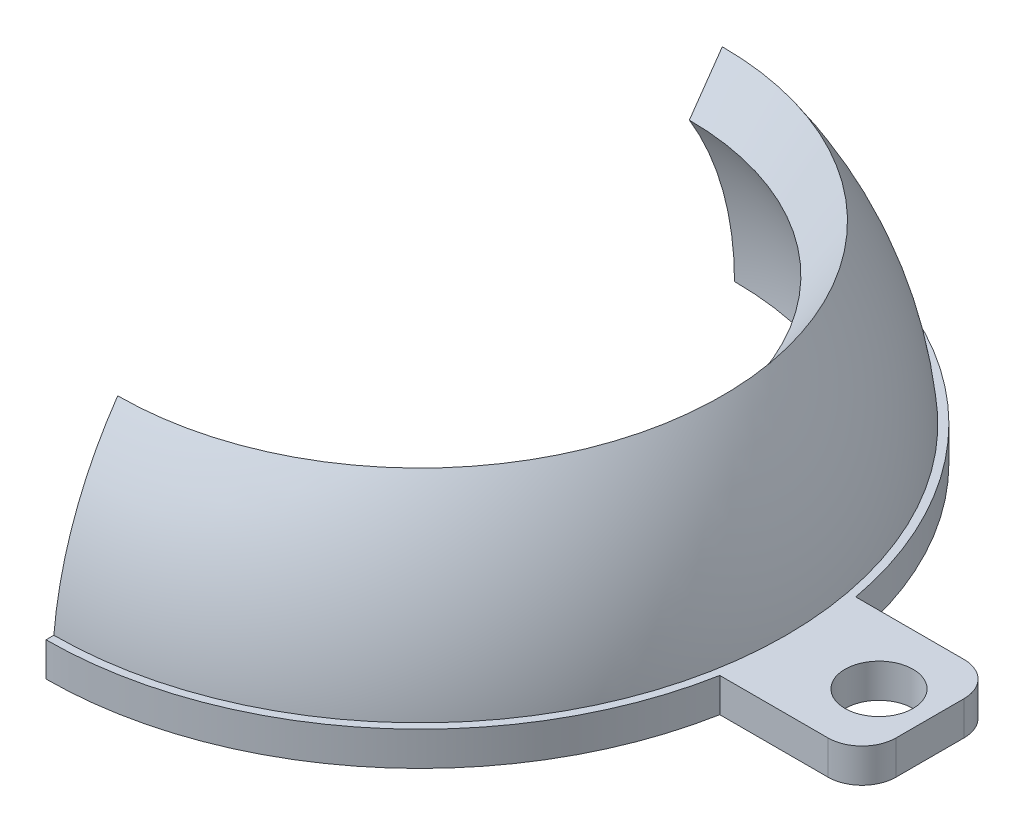
ISO-10303-21;
HEADER;
FILE_DESCRIPTION(('STEP AP214'),'2;1');
FILE_NAME('part.step','',(''),(''),'','','');
FILE_SCHEMA(('AUTOMOTIVE_DESIGN { 1 0 10303 214 1 1 1 1 }'));
ENDSEC;
DATA;
#1=APPLICATION_CONTEXT('core data for automotive mechanical design processes');
#2=APPLICATION_PROTOCOL_DEFINITION('international standard','automotive_design',2000,#1);
#3=PRODUCT_CONTEXT('',#1,'mechanical');
#4=PRODUCT('Part','Part','',(#3));
#5=PRODUCT_RELATED_PRODUCT_CATEGORY('part','',(#4));
#6=PRODUCT_DEFINITION_FORMATION('','',#4);
#7=PRODUCT_DEFINITION_CONTEXT('part definition',#1,'design');
#8=PRODUCT_DEFINITION('design','',#6,#7);
#9=PRODUCT_DEFINITION_SHAPE('','',#8);
#10=(LENGTH_UNIT() NAMED_UNIT(*) SI_UNIT(.MILLI.,.METRE.));
#11=(NAMED_UNIT(*) PLANE_ANGLE_UNIT() SI_UNIT($,.RADIAN.));
#12=(NAMED_UNIT(*) SI_UNIT($,.STERADIAN.) SOLID_ANGLE_UNIT());
#13=UNCERTAINTY_MEASURE_WITH_UNIT(LENGTH_MEASURE(1.E-05),#10,'distance_accuracy_value','');
#14=(GEOMETRIC_REPRESENTATION_CONTEXT(3) GLOBAL_UNCERTAINTY_ASSIGNED_CONTEXT((#13)) GLOBAL_UNIT_ASSIGNED_CONTEXT((#10,
#11,#12)) REPRESENTATION_CONTEXT('',''));
#15=CARTESIAN_POINT('',(0.,0.,0.));
#16=DIRECTION('',(0.,0.,1.));
#17=DIRECTION('',(1.,0.,0.));
#18=AXIS2_PLACEMENT_3D('',#15,#16,#17);
#19=CARTESIAN_POINT('',(0.,0.,0.));
#20=DIRECTION('',(0.,1.,0.));
#21=DIRECTION('',(0.,0.,1.));
#22=AXIS2_PLACEMENT_3D('',#19,#20,#21);
#23=PLANE('',#22);
#24=CARTESIAN_POINT('',(27.,0.,0.));
#25=DIRECTION('',(0.,1.,0.));
#26=DIRECTION('',(0.,0.,1.));
#27=AXIS2_PLACEMENT_3D('',#24,#25,#26);
#28=CIRCLE('',#27,2.);
#29=CARTESIAN_POINT('',(27.,0.,2.));
#30=VERTEX_POINT('',#29);
#31=EDGE_CURVE('E217',#30,#30,#28,.T.);
#32=ORIENTED_EDGE('',*,*,#31,.T.);
#33=EDGE_LOOP('',(#32));
#34=FACE_BOUND('',#33,.T.);
#35=CARTESIAN_POINT('',(0.,0.,0.));
#36=DIRECTION('',(0.,1.,0.));
#37=DIRECTION('',(0.,0.,1.));
#38=AXIS2_PLACEMENT_3D('',#35,#36,#37);
#39=CIRCLE('',#38,22.);
#40=CARTESIAN_POINT('',(0.,0.,22.));
#41=VERTEX_POINT('',#40);
#42=CARTESIAN_POINT('',(21.6333076527839,0.,4.));
#43=VERTEX_POINT('',#42);
#44=EDGE_CURVE('E286',#41,#43,#39,.T.);
#45=ORIENTED_EDGE('',*,*,#44,.F.);
#46=DIRECTION('',(0.,0.,-1.));
#47=VECTOR('',#46,1.);
#48=CARTESIAN_POINT('',(0.,0.,0.));
#49=LINE('',#48,#47);
#50=CARTESIAN_POINT('',(0.,0.,18.5));
#51=VERTEX_POINT('',#50);
#52=EDGE_CURVE('E313',#41,#51,#49,.T.);
#53=ORIENTED_EDGE('',*,*,#52,.T.);
#54=CARTESIAN_POINT('',(0.,0.,0.));
#55=DIRECTION('',(0.,1.,0.));
#56=DIRECTION('',(-1.,0.,0.));
#57=AXIS2_PLACEMENT_3D('',#54,#55,#56);
#58=CIRCLE('',#57,18.5);
#59=CARTESIAN_POINT('',(0.,0.,-18.5));
#60=VERTEX_POINT('',#59);
#61=EDGE_CURVE('E201',#51,#60,#58,.T.);
#62=ORIENTED_EDGE('',*,*,#61,.T.);
#63=CARTESIAN_POINT('',(0.,0.,-22.));
#64=VERTEX_POINT('',#63);
#65=EDGE_CURVE('E204',#60,#64,#49,.T.);
#66=ORIENTED_EDGE('',*,*,#65,.T.);
#67=CARTESIAN_POINT('',(21.6333076527839,0.,-4.));
#68=VERTEX_POINT('',#67);
#69=EDGE_CURVE('E283',#68,#64,#39,.T.);
#70=ORIENTED_EDGE('',*,*,#69,.F.);
#71=DIRECTION('',(-1.,0.,0.));
#72=VECTOR('',#71,1.);
#73=CARTESIAN_POINT('',(0.,0.,-4.));
#74=LINE('',#73,#72);
#75=CARTESIAN_POINT('',(28.,0.,-4.00000000000001));
#76=VERTEX_POINT('',#75);
#77=EDGE_CURVE('E242',#76,#68,#74,.T.);
#78=ORIENTED_EDGE('',*,*,#77,.F.);
#79=CARTESIAN_POINT('',(28.,0.,-2.));
#80=DIRECTION('',(0.,1.,0.));
#81=DIRECTION('',(0.,0.,1.));
#82=AXIS2_PLACEMENT_3D('',#79,#80,#81);
#83=CIRCLE('',#82,2.);
#84=CARTESIAN_POINT('',(30.,0.,-2.00000000000001));
#85=VERTEX_POINT('',#84);
#86=EDGE_CURVE('E238',#76,#85,#83,.F.);
#87=ORIENTED_EDGE('',*,*,#86,.T.);
#88=DIRECTION('',(0.,0.,1.));
#89=VECTOR('',#88,1.);
#90=CARTESIAN_POINT('',(30.,0.,0.));
#91=LINE('',#90,#89);
#92=CARTESIAN_POINT('',(30.,0.,1.99999999999999));
#93=VERTEX_POINT('',#92);
#94=EDGE_CURVE('E255',#85,#93,#91,.T.);
#95=ORIENTED_EDGE('',*,*,#94,.T.);
#96=CARTESIAN_POINT('',(28.,0.,2.));
#97=DIRECTION('',(0.,1.,0.));
#98=DIRECTION('',(0.,0.,1.));
#99=AXIS2_PLACEMENT_3D('',#96,#97,#98);
#100=CIRCLE('',#99,2.);
#101=CARTESIAN_POINT('',(28.,0.,3.99999999999999));
#102=VERTEX_POINT('',#101);
#103=EDGE_CURVE('E251',#93,#102,#100,.F.);
#104=ORIENTED_EDGE('',*,*,#103,.T.);
#105=DIRECTION('',(-1.,0.,0.));
#106=VECTOR('',#105,1.);
#107=CARTESIAN_POINT('',(0.,0.,4.));
#108=LINE('',#107,#106);
#109=EDGE_CURVE('E247',#102,#43,#108,.T.);
#110=ORIENTED_EDGE('',*,*,#109,.T.);
#111=EDGE_LOOP('',(#45,#53,#62,#66,#70,#78,#87,#95,#104,#110));
#112=FACE_BOUND('',#111,.T.);
#113=ADVANCED_FACE('F89',(#34,#112),#23,.F.);
#114=CARTESIAN_POINT('',(0.,2.,0.));
#115=DIRECTION('',(0.,1.,0.));
#116=DIRECTION('',(0.,0.,1.));
#117=AXIS2_PLACEMENT_3D('',#114,#115,#116);
#118=PLANE('',#117);
#119=DIRECTION('',(0.,0.,-1.));
#120=VECTOR('',#119,1.);
#121=CARTESIAN_POINT('',(0.,2.,0.));
#122=LINE('',#121,#120);
#123=CARTESIAN_POINT('',(0.,2.,22.));
#124=VERTEX_POINT('',#123);
#125=CARTESIAN_POINT('',(0.,2.,21.540659228538));
#126=VERTEX_POINT('',#125);
#127=EDGE_CURVE('E112',#124,#126,#122,.T.);
#128=ORIENTED_EDGE('',*,*,#127,.F.);
#129=CARTESIAN_POINT('',(0.,2.,0.));
#130=DIRECTION('',(0.,1.,0.));
#131=DIRECTION('',(0.,0.,1.));
#132=AXIS2_PLACEMENT_3D('',#129,#130,#131);
#133=CIRCLE('',#132,22.);
#134=CARTESIAN_POINT('',(21.6333076527839,2.,4.));
#135=VERTEX_POINT('',#134);
#136=EDGE_CURVE('E282',#124,#135,#133,.T.);
#137=ORIENTED_EDGE('',*,*,#136,.T.);
#138=DIRECTION('',(-1.,0.,0.));
#139=VECTOR('',#138,1.);
#140=CARTESIAN_POINT('',(0.,2.,4.));
#141=LINE('',#140,#139);
#142=CARTESIAN_POINT('',(28.,2.,3.99999999999999));
#143=VERTEX_POINT('',#142);
#144=EDGE_CURVE('E221',#143,#135,#141,.T.);
#145=ORIENTED_EDGE('',*,*,#144,.F.);
#146=CARTESIAN_POINT('',(28.,2.,2.));
#147=DIRECTION('',(0.,1.,0.));
#148=DIRECTION('',(0.,0.,1.));
#149=AXIS2_PLACEMENT_3D('',#146,#147,#148);
#150=CIRCLE('',#149,2.);
#151=CARTESIAN_POINT('',(30.,2.,1.99999999999999));
#152=VERTEX_POINT('',#151);
#153=EDGE_CURVE('E225',#152,#143,#150,.F.);
#154=ORIENTED_EDGE('',*,*,#153,.F.);
#155=DIRECTION('',(0.,0.,1.));
#156=VECTOR('',#155,1.);
#157=CARTESIAN_POINT('',(30.,2.,0.));
#158=LINE('',#157,#156);
#159=CARTESIAN_POINT('',(30.,2.,-2.00000000000001));
#160=VERTEX_POINT('',#159);
#161=EDGE_CURVE('E229',#160,#152,#158,.T.);
#162=ORIENTED_EDGE('',*,*,#161,.F.);
#163=CARTESIAN_POINT('',(28.,2.,-2.));
#164=DIRECTION('',(0.,1.,0.));
#165=DIRECTION('',(0.,0.,1.));
#166=AXIS2_PLACEMENT_3D('',#163,#164,#165);
#167=CIRCLE('',#166,2.);
#168=CARTESIAN_POINT('',(28.,2.,-4.00000000000001));
#169=VERTEX_POINT('',#168);
#170=EDGE_CURVE('E212',#169,#160,#167,.F.);
#171=ORIENTED_EDGE('',*,*,#170,.F.);
#172=DIRECTION('',(-1.,0.,0.));
#173=VECTOR('',#172,1.);
#174=CARTESIAN_POINT('',(0.,2.,-4.));
#175=LINE('',#174,#173);
#176=CARTESIAN_POINT('',(21.6333076527839,2.,-4.));
#177=VERTEX_POINT('',#176);
#178=EDGE_CURVE('E216',#169,#177,#175,.T.);
#179=ORIENTED_EDGE('',*,*,#178,.T.);
#180=CARTESIAN_POINT('',(0.,2.,-22.));
#181=VERTEX_POINT('',#180);
#182=EDGE_CURVE('E243',#177,#181,#133,.T.);
#183=ORIENTED_EDGE('',*,*,#182,.T.);
#184=CARTESIAN_POINT('',(0.,2.,-21.540659228538));
#185=VERTEX_POINT('',#184);
#186=EDGE_CURVE('E315',#185,#181,#122,.T.);
#187=ORIENTED_EDGE('',*,*,#186,.F.);
#188=CARTESIAN_POINT('',(0.,2.,0.));
#189=DIRECTION('',(0.,1.,0.));
#190=DIRECTION('',(0.,0.,1.));
#191=AXIS2_PLACEMENT_3D('',#188,#189,#190);
#192=CIRCLE('',#191,21.540659228538);
#193=EDGE_CURVE('E211',#185,#126,#192,.F.);
#194=ORIENTED_EDGE('',*,*,#193,.T.);
#195=EDGE_LOOP('',(#128,#137,#145,#154,#162,#171,#179,#183,#187,#194));
#196=FACE_BOUND('',#195,.T.);
#197=CARTESIAN_POINT('',(27.,2.,0.));
#198=DIRECTION('',(0.,1.,0.));
#199=DIRECTION('',(0.,0.,1.));
#200=AXIS2_PLACEMENT_3D('',#197,#198,#199);
#201=CIRCLE('',#200,2.);
#202=CARTESIAN_POINT('',(27.,2.,2.));
#203=VERTEX_POINT('',#202);
#204=EDGE_CURVE('E233',#203,#203,#201,.T.);
#205=ORIENTED_EDGE('',*,*,#204,.F.);
#206=EDGE_LOOP('',(#205));
#207=FACE_BOUND('',#206,.T.);
#208=ADVANCED_FACE('F308',(#196,#207),#118,.T.);
#209=CARTESIAN_POINT('',(27.,2.,0.));
#210=DIRECTION('',(0.,-1.,0.));
#211=DIRECTION('',(0.,0.,-1.));
#212=AXIS2_PLACEMENT_3D('',#209,#210,#211);
#213=CYLINDRICAL_SURFACE('',#212,2.);
#214=ORIENTED_EDGE('',*,*,#204,.T.);
#215=EDGE_LOOP('',(#214));
#216=FACE_BOUND('',#215,.T.);
#217=ORIENTED_EDGE('',*,*,#31,.F.);
#218=EDGE_LOOP('',(#217));
#219=FACE_BOUND('',#218,.T.);
#220=ADVANCED_FACE('F353',(#216,#219),#213,.F.);
#221=CARTESIAN_POINT('',(28.,2.,2.));
#222=DIRECTION('',(0.,-1.,0.));
#223=DIRECTION('',(0.,0.,-1.));
#224=AXIS2_PLACEMENT_3D('',#221,#222,#223);
#225=CYLINDRICAL_SURFACE('',#224,2.);
#226=ORIENTED_EDGE('',*,*,#103,.F.);
#227=DIRECTION('',(0.,-1.,0.));
#228=VECTOR('',#227,1.);
#229=CARTESIAN_POINT('',(30.,2.,1.99999999999999));
#230=LINE('',#229,#228);
#231=EDGE_CURVE('E264',#152,#93,#230,.T.);
#232=ORIENTED_EDGE('',*,*,#231,.F.);
#233=ORIENTED_EDGE('',*,*,#153,.T.);
#234=DIRECTION('',(0.,-1.,0.));
#235=VECTOR('',#234,1.);
#236=CARTESIAN_POINT('',(28.,2.,3.99999999999999));
#237=LINE('',#236,#235);
#238=EDGE_CURVE('E267',#143,#102,#237,.T.);
#239=ORIENTED_EDGE('',*,*,#238,.T.);
#240=EDGE_LOOP('',(#226,#232,#233,#239));
#241=FACE_BOUND('',#240,.T.);
#242=ADVANCED_FACE('F306',(#241),#225,.T.);
#243=CARTESIAN_POINT('',(30.,2.,0.));
#244=DIRECTION('',(1.,0.,0.));
#245=DIRECTION('',(0.,0.,-1.));
#246=AXIS2_PLACEMENT_3D('',#243,#244,#245);
#247=PLANE('',#246);
#248=ORIENTED_EDGE('',*,*,#94,.F.);
#249=DIRECTION('',(0.,-1.,0.));
#250=VECTOR('',#249,1.);
#251=CARTESIAN_POINT('',(30.,2.,-2.00000000000001));
#252=LINE('',#251,#250);
#253=EDGE_CURVE('E237',#160,#85,#252,.T.);
#254=ORIENTED_EDGE('',*,*,#253,.F.);
#255=ORIENTED_EDGE('',*,*,#161,.T.);
#256=ORIENTED_EDGE('',*,*,#231,.T.);
#257=EDGE_LOOP('',(#248,#254,#255,#256));
#258=FACE_BOUND('',#257,.T.);
#259=ADVANCED_FACE('F346',(#258),#247,.T.);
#260=CARTESIAN_POINT('',(28.,2.,-2.));
#261=DIRECTION('',(0.,-1.,0.));
#262=DIRECTION('',(0.,0.,-1.));
#263=AXIS2_PLACEMENT_3D('',#260,#261,#262);
#264=CYLINDRICAL_SURFACE('',#263,2.);
#265=ORIENTED_EDGE('',*,*,#86,.F.);
#266=DIRECTION('',(0.,-1.,0.));
#267=VECTOR('',#266,1.);
#268=CARTESIAN_POINT('',(28.,2.,-4.00000000000001));
#269=LINE('',#268,#267);
#270=EDGE_CURVE('E184',#169,#76,#269,.T.);
#271=ORIENTED_EDGE('',*,*,#270,.F.);
#272=ORIENTED_EDGE('',*,*,#170,.T.);
#273=ORIENTED_EDGE('',*,*,#253,.T.);
#274=EDGE_LOOP('',(#265,#271,#272,#273));
#275=FACE_BOUND('',#274,.T.);
#276=ADVANCED_FACE('F344',(#275),#264,.T.);
#277=CARTESIAN_POINT('',(0.,2.,4.));
#278=DIRECTION('',(0.,0.,1.));
#279=DIRECTION('',(1.,0.,0.));
#280=AXIS2_PLACEMENT_3D('',#277,#278,#279);
#281=PLANE('',#280);
#282=ORIENTED_EDGE('',*,*,#109,.F.);
#283=ORIENTED_EDGE('',*,*,#238,.F.);
#284=ORIENTED_EDGE('',*,*,#144,.T.);
#285=DIRECTION('',(0.,-1.,0.));
#286=VECTOR('',#285,1.);
#287=CARTESIAN_POINT('',(21.6333076527839,2.,4.));
#288=LINE('',#287,#286);
#289=EDGE_CURVE('E270',#135,#43,#288,.T.);
#290=ORIENTED_EDGE('',*,*,#289,.T.);
#291=EDGE_LOOP('',(#282,#283,#284,#290));
#292=FACE_BOUND('',#291,.T.);
#293=ADVANCED_FACE('F301',(#292),#281,.T.);
#294=CARTESIAN_POINT('',(0.,2.,-4.));
#295=DIRECTION('',(0.,0.,1.));
#296=DIRECTION('',(1.,0.,0.));
#297=AXIS2_PLACEMENT_3D('',#294,#295,#296);
#298=PLANE('',#297);
#299=ORIENTED_EDGE('',*,*,#77,.T.);
#300=DIRECTION('',(0.,-1.,0.));
#301=VECTOR('',#300,1.);
#302=CARTESIAN_POINT('',(21.6333076527839,2.,-4.));
#303=LINE('',#302,#301);
#304=EDGE_CURVE('E274',#177,#68,#303,.T.);
#305=ORIENTED_EDGE('',*,*,#304,.F.);
#306=ORIENTED_EDGE('',*,*,#178,.F.);
#307=ORIENTED_EDGE('',*,*,#270,.T.);
#308=EDGE_LOOP('',(#299,#305,#306,#307));
#309=FACE_BOUND('',#308,.T.);
#310=ADVANCED_FACE('F340',(#309),#298,.F.);
#311=CARTESIAN_POINT('',(0.,2.,0.));
#312=DIRECTION('',(0.,-1.,0.));
#313=DIRECTION('',(0.,0.,-1.));
#314=AXIS2_PLACEMENT_3D('',#311,#312,#313);
#315=CYLINDRICAL_SURFACE('',#314,22.);
#316=ORIENTED_EDGE('',*,*,#69,.T.);
#317=DIRECTION('',(0.,-1.,0.));
#318=VECTOR('',#317,1.);
#319=CARTESIAN_POINT('',(0.,2.,-22.));
#320=LINE('',#319,#318);
#321=EDGE_CURVE('E197',#64,#181,#320,.F.);
#322=ORIENTED_EDGE('',*,*,#321,.T.);
#323=ORIENTED_EDGE('',*,*,#182,.F.);
#324=ORIENTED_EDGE('',*,*,#304,.T.);
#325=EDGE_LOOP('',(#316,#322,#323,#324));
#326=FACE_BOUND('',#325,.T.);
#327=ADVANCED_FACE('F336',(#326),#315,.T.);
#328=ORIENTED_EDGE('',*,*,#136,.F.);
#329=DIRECTION('',(0.,-1.,0.));
#330=VECTOR('',#329,1.);
#331=CARTESIAN_POINT('',(0.,2.,22.));
#332=LINE('',#331,#330);
#333=EDGE_CURVE('E296',#124,#41,#332,.T.);
#334=ORIENTED_EDGE('',*,*,#333,.T.);
#335=ORIENTED_EDGE('',*,*,#44,.T.);
#336=ORIENTED_EDGE('',*,*,#289,.F.);
#337=EDGE_LOOP('',(#328,#334,#335,#336));
#338=FACE_BOUND('',#337,.T.);
#339=ADVANCED_FACE('F91',(#338),#315,.T.);
#340=CARTESIAN_POINT('',(0.,0.,0.));
#341=DIRECTION('',(0.,1.,0.));
#342=DIRECTION('',(-1.,0.,0.));
#343=AXIS2_PLACEMENT_3D('',#340,#341,#342);
#344=SPHERICAL_SURFACE('',#343,18.5);
#345=CARTESIAN_POINT('',(0.,0.,0.));
#346=DIRECTION('',(1.,0.,0.));
#347=DIRECTION('',(0.,0.,-1.));
#348=AXIS2_PLACEMENT_3D('',#345,#346,#347);
#349=CIRCLE('',#348,18.5);
#350=CARTESIAN_POINT('',(0.,9.55129480582041,-15.8436980384097));
#351=VERTEX_POINT('',#350);
#352=EDGE_CURVE('E320',#60,#351,#349,.T.);
#353=ORIENTED_EDGE('',*,*,#352,.F.);
#354=ORIENTED_EDGE('',*,*,#61,.F.);
#355=CARTESIAN_POINT('',(0.,9.55129480582041,15.8436980384097));
#356=VERTEX_POINT('',#355);
#357=EDGE_CURVE('E193',#356,#51,#349,.T.);
#358=ORIENTED_EDGE('',*,*,#357,.F.);
#359=CARTESIAN_POINT('',(0.,9.55129480582041,0.));
#360=DIRECTION('',(0.,1.,0.));
#361=DIRECTION('',(-1.,0.,0.));
#362=AXIS2_PLACEMENT_3D('',#359,#360,#361);
#363=CIRCLE('',#362,15.8436980384097);
#364=EDGE_CURVE('E191',#356,#351,#363,.T.);
#365=ORIENTED_EDGE('',*,*,#364,.T.);
#366=EDGE_LOOP('',(#353,#354,#358,#365));
#367=FACE_BOUND('',#366,.T.);
#368=ADVANCED_FACE('F332',(#367),#344,.F.);
#369=CARTESIAN_POINT('',(0.,9.55129480582041,0.));
#370=DIRECTION('',(0.,1.,0.));
#371=DIRECTION('',(-1.,0.,0.));
#372=AXIS2_PLACEMENT_3D('',#369,#370,#371);
#373=CONICAL_SURFACE('',#372,15.8436980384097,0.610865238198019);
#374=DIRECTION('',(0.,0.819152044288989,-0.573576436351049));
#375=VECTOR('',#374,1.);
#376=CARTESIAN_POINT('',(0.,-13.0758509671582,0.));
#377=LINE('',#376,#375);
#378=CARTESIAN_POINT('',(0.,12.3201019169223,-17.782437649452));
#379=VERTEX_POINT('',#378);
#380=EDGE_CURVE('E105',#351,#379,#377,.T.);
#381=ORIENTED_EDGE('',*,*,#380,.F.);
#382=ORIENTED_EDGE('',*,*,#364,.F.);
#383=DIRECTION('',(0.,-0.819152044288989,-0.573576436351049));
#384=VECTOR('',#383,1.);
#385=CARTESIAN_POINT('',(0.,-13.0758509671582,0.));
#386=LINE('',#385,#384);
#387=CARTESIAN_POINT('',(0.,12.3201019169223,17.782437649452));
#388=VERTEX_POINT('',#387);
#389=EDGE_CURVE('E177',#388,#356,#386,.T.);
#390=ORIENTED_EDGE('',*,*,#389,.F.);
#391=CARTESIAN_POINT('',(0.,12.3201019169223,0.));
#392=DIRECTION('',(0.,1.,0.));
#393=DIRECTION('',(-1.,0.,0.));
#394=AXIS2_PLACEMENT_3D('',#391,#392,#393);
#395=CIRCLE('',#394,17.782437649452);
#396=EDGE_CURVE('E189',#388,#379,#395,.T.);
#397=ORIENTED_EDGE('',*,*,#396,.T.);
#398=EDGE_LOOP('',(#381,#382,#390,#397));
#399=FACE_BOUND('',#398,.T.);
#400=ADVANCED_FACE('F188',(#399),#373,.F.);
#401=CARTESIAN_POINT('',(0.,0.,0.));
#402=DIRECTION('',(0.,1.,0.));
#403=DIRECTION('',(-1.,0.,0.));
#404=AXIS2_PLACEMENT_3D('',#401,#402,#403);
#405=SPHERICAL_SURFACE('',#404,21.6333076527839);
#406=ORIENTED_EDGE('',*,*,#193,.F.);
#407=CARTESIAN_POINT('',(0.,0.,0.));
#408=DIRECTION('',(1.,0.,0.));
#409=DIRECTION('',(0.,0.,-1.));
#410=AXIS2_PLACEMENT_3D('',#407,#408,#409);
#411=CIRCLE('',#410,21.6333076527839);
#412=EDGE_CURVE('E12',#185,#379,#411,.T.);
#413=ORIENTED_EDGE('',*,*,#412,.T.);
#414=ORIENTED_EDGE('',*,*,#396,.F.);
#415=EDGE_CURVE('E93',#388,#126,#411,.T.);
#416=ORIENTED_EDGE('',*,*,#415,.T.);
#417=EDGE_LOOP('',(#406,#413,#414,#416));
#418=FACE_BOUND('',#417,.T.);
#419=ADVANCED_FACE('F195',(#418),#405,.T.);
#420=CARTESIAN_POINT('',(0.,0.,0.));
#421=DIRECTION('',(1.,0.,0.));
#422=DIRECTION('',(0.,0.,-1.));
#423=AXIS2_PLACEMENT_3D('',#420,#421,#422);
#424=PLANE('',#423);
#425=ORIENTED_EDGE('',*,*,#127,.T.);
#426=ORIENTED_EDGE('',*,*,#415,.F.);
#427=ORIENTED_EDGE('',*,*,#389,.T.);
#428=ORIENTED_EDGE('',*,*,#357,.T.);
#429=ORIENTED_EDGE('',*,*,#52,.F.);
#430=ORIENTED_EDGE('',*,*,#333,.F.);
#431=EDGE_LOOP('',(#425,#426,#427,#428,#429,#430));
#432=FACE_BOUND('',#431,.T.);
#433=ADVANCED_FACE('F176',(#432),#424,.F.);
#434=ORIENTED_EDGE('',*,*,#65,.F.);
#435=ORIENTED_EDGE('',*,*,#352,.T.);
#436=ORIENTED_EDGE('',*,*,#380,.T.);
#437=ORIENTED_EDGE('',*,*,#412,.F.);
#438=ORIENTED_EDGE('',*,*,#186,.T.);
#439=ORIENTED_EDGE('',*,*,#321,.F.);
#440=EDGE_LOOP('',(#434,#435,#436,#437,#438,#439));
#441=FACE_BOUND('',#440,.T.);
#442=ADVANCED_FACE('F329',(#441),#424,.F.);
#443=CLOSED_SHELL('',(#113,#208,#220,#242,#259,#276,#293,#310,#327,#339,#368,#400,#419,#433,#442));
#444=MANIFOLD_SOLID_BREP('B2',#443);
#445=ADVANCED_BREP_SHAPE_REPRESENTATION('',(#18,#444),#14);
#446=SHAPE_DEFINITION_REPRESENTATION(#9,#445);
ENDSEC;
END-ISO-10303-21;
